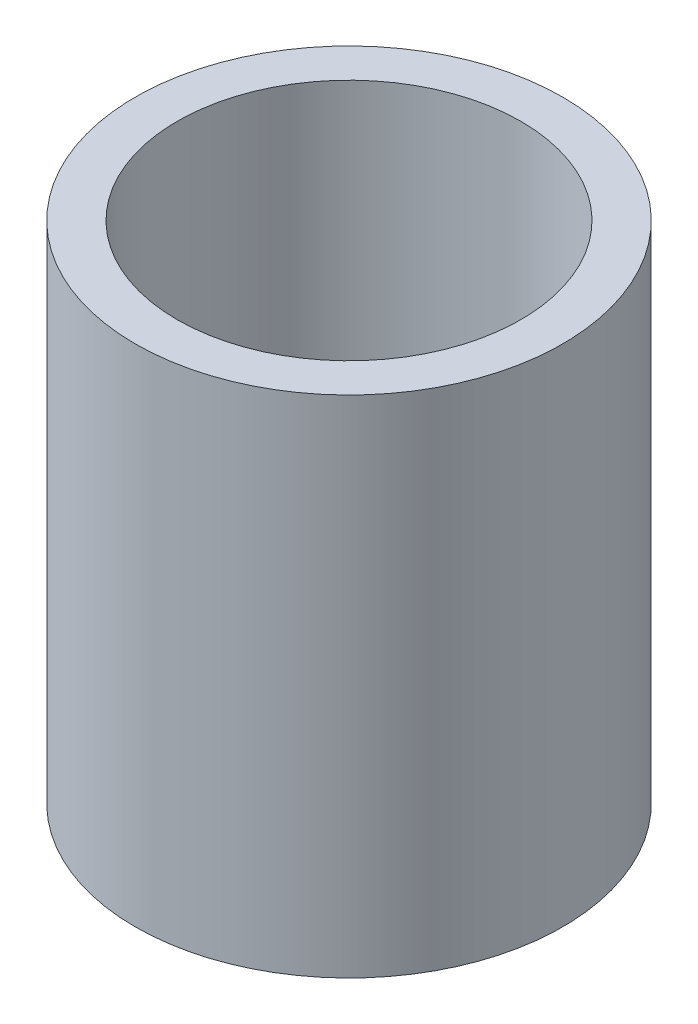
ISO-10303-21;
HEADER;
FILE_DESCRIPTION(('STEP AP214'),'2;1');
FILE_NAME('part.step','',(''),(''),'','','');
FILE_SCHEMA(('AUTOMOTIVE_DESIGN { 1 0 10303 214 1 1 1 1 }'));
ENDSEC;
DATA;
#1=APPLICATION_CONTEXT('core data for automotive mechanical design processes');
#2=APPLICATION_PROTOCOL_DEFINITION('international standard','automotive_design',2000,#1);
#3=PRODUCT_CONTEXT('',#1,'mechanical');
#4=PRODUCT('Part','Part','',(#3));
#5=PRODUCT_RELATED_PRODUCT_CATEGORY('part','',(#4));
#6=PRODUCT_DEFINITION_FORMATION('','',#4);
#7=PRODUCT_DEFINITION_CONTEXT('part definition',#1,'design');
#8=PRODUCT_DEFINITION('design','',#6,#7);
#9=PRODUCT_DEFINITION_SHAPE('','',#8);
#10=(LENGTH_UNIT() NAMED_UNIT(*) SI_UNIT(.MILLI.,.METRE.));
#11=(NAMED_UNIT(*) PLANE_ANGLE_UNIT() SI_UNIT($,.RADIAN.));
#12=(NAMED_UNIT(*) SI_UNIT($,.STERADIAN.) SOLID_ANGLE_UNIT());
#13=UNCERTAINTY_MEASURE_WITH_UNIT(LENGTH_MEASURE(1.E-05),#10,'distance_accuracy_value','');
#14=(GEOMETRIC_REPRESENTATION_CONTEXT(3) GLOBAL_UNCERTAINTY_ASSIGNED_CONTEXT((#13)) GLOBAL_UNIT_ASSIGNED_CONTEXT((#10,
#11,#12)) REPRESENTATION_CONTEXT('',''));
#15=CARTESIAN_POINT('',(0.,0.,0.));
#16=DIRECTION('',(0.,0.,1.));
#17=DIRECTION('',(1.,0.,0.));
#18=AXIS2_PLACEMENT_3D('',#15,#16,#17);
#19=CARTESIAN_POINT('',(0.,55.2662795,0.));
#20=DIRECTION('',(0.,-1.,0.));
#21=DIRECTION('',(0.,0.,-1.));
#22=AXIS2_PLACEMENT_3D('',#19,#20,#21);
#23=PLANE('',#22);
#24=CARTESIAN_POINT('',(0.,55.2662795,0.));
#25=DIRECTION('',(0.,-1.,0.));
#26=DIRECTION('',(0.,0.,-1.));
#27=AXIS2_PLACEMENT_3D('',#24,#25,#26);
#28=CIRCLE('',#27,6.35);
#29=CARTESIAN_POINT('',(0.,55.2662795,-6.35));
#30=VERTEX_POINT('',#29);
#31=EDGE_CURVE('E10',#30,#30,#28,.T.);
#32=ORIENTED_EDGE('',*,*,#31,.T.);
#33=EDGE_LOOP('',(#32));
#34=FACE_BOUND('',#33,.T.);
#35=CARTESIAN_POINT('',(0.,55.2662795,0.));
#36=DIRECTION('',(0.,-1.,0.));
#37=DIRECTION('',(0.,0.,-1.));
#38=AXIS2_PLACEMENT_3D('',#35,#36,#37);
#39=CIRCLE('',#38,5.1054);
#40=CARTESIAN_POINT('',(0.,55.2662795,-5.1054));
#41=VERTEX_POINT('',#40);
#42=EDGE_CURVE('E42',#41,#41,#39,.T.);
#43=ORIENTED_EDGE('',*,*,#42,.F.);
#44=EDGE_LOOP('',(#43));
#45=FACE_BOUND('',#44,.T.);
#46=ADVANCED_FACE('F31',(#34,#45),#23,.T.);
#47=CARTESIAN_POINT('',(0.,70.2662795,0.));
#48=DIRECTION('',(0.,-1.,0.));
#49=DIRECTION('',(0.,0.,-1.));
#50=AXIS2_PLACEMENT_3D('',#47,#48,#49);
#51=PLANE('',#50);
#52=CARTESIAN_POINT('',(0.,70.2662795,0.));
#53=DIRECTION('',(0.,-1.,0.));
#54=DIRECTION('',(0.,0.,-1.));
#55=AXIS2_PLACEMENT_3D('',#52,#53,#54);
#56=CIRCLE('',#55,6.35);
#57=CARTESIAN_POINT('',(0.,70.2662795,-6.35));
#58=VERTEX_POINT('',#57);
#59=EDGE_CURVE('E35',#58,#58,#56,.T.);
#60=ORIENTED_EDGE('',*,*,#59,.F.);
#61=EDGE_LOOP('',(#60));
#62=FACE_BOUND('',#61,.T.);
#63=CARTESIAN_POINT('',(0.,70.2662795,0.));
#64=DIRECTION('',(0.,-1.,0.));
#65=DIRECTION('',(0.,0.,-1.));
#66=AXIS2_PLACEMENT_3D('',#63,#64,#65);
#67=CIRCLE('',#66,5.1054);
#68=CARTESIAN_POINT('',(0.,70.2662795,-5.1054));
#69=VERTEX_POINT('',#68);
#70=EDGE_CURVE('E44',#69,#69,#67,.T.);
#71=ORIENTED_EDGE('',*,*,#70,.T.);
#72=EDGE_LOOP('',(#71));
#73=FACE_BOUND('',#72,.T.);
#74=ADVANCED_FACE('F54',(#62,#73),#51,.F.);
#75=CARTESIAN_POINT('',(0.,55.2662795,0.));
#76=DIRECTION('',(0.,1.,0.));
#77=DIRECTION('',(0.,0.,1.));
#78=AXIS2_PLACEMENT_3D('',#75,#76,#77);
#79=CYLINDRICAL_SURFACE('',#78,6.35);
#80=ORIENTED_EDGE('',*,*,#31,.F.);
#81=EDGE_LOOP('',(#80));
#82=FACE_BOUND('',#81,.T.);
#83=ORIENTED_EDGE('',*,*,#59,.T.);
#84=EDGE_LOOP('',(#83));
#85=FACE_BOUND('',#84,.T.);
#86=ADVANCED_FACE('F33',(#82,#85),#79,.T.);
#87=CARTESIAN_POINT('',(0.,55.2662795,0.));
#88=DIRECTION('',(0.,1.,0.));
#89=DIRECTION('',(0.,0.,1.));
#90=AXIS2_PLACEMENT_3D('',#87,#88,#89);
#91=CYLINDRICAL_SURFACE('',#90,5.1054);
#92=ORIENTED_EDGE('',*,*,#42,.T.);
#93=EDGE_LOOP('',(#92));
#94=FACE_BOUND('',#93,.T.);
#95=ORIENTED_EDGE('',*,*,#70,.F.);
#96=EDGE_LOOP('',(#95));
#97=FACE_BOUND('',#96,.T.);
#98=ADVANCED_FACE('F50',(#94,#97),#91,.F.);
#99=CLOSED_SHELL('',(#46,#74,#86,#98));
#100=MANIFOLD_SOLID_BREP('B2',#99);
#101=ADVANCED_BREP_SHAPE_REPRESENTATION('',(#18,#100),#14);
#102=SHAPE_DEFINITION_REPRESENTATION(#9,#101);
ENDSEC;
END-ISO-10303-21;
